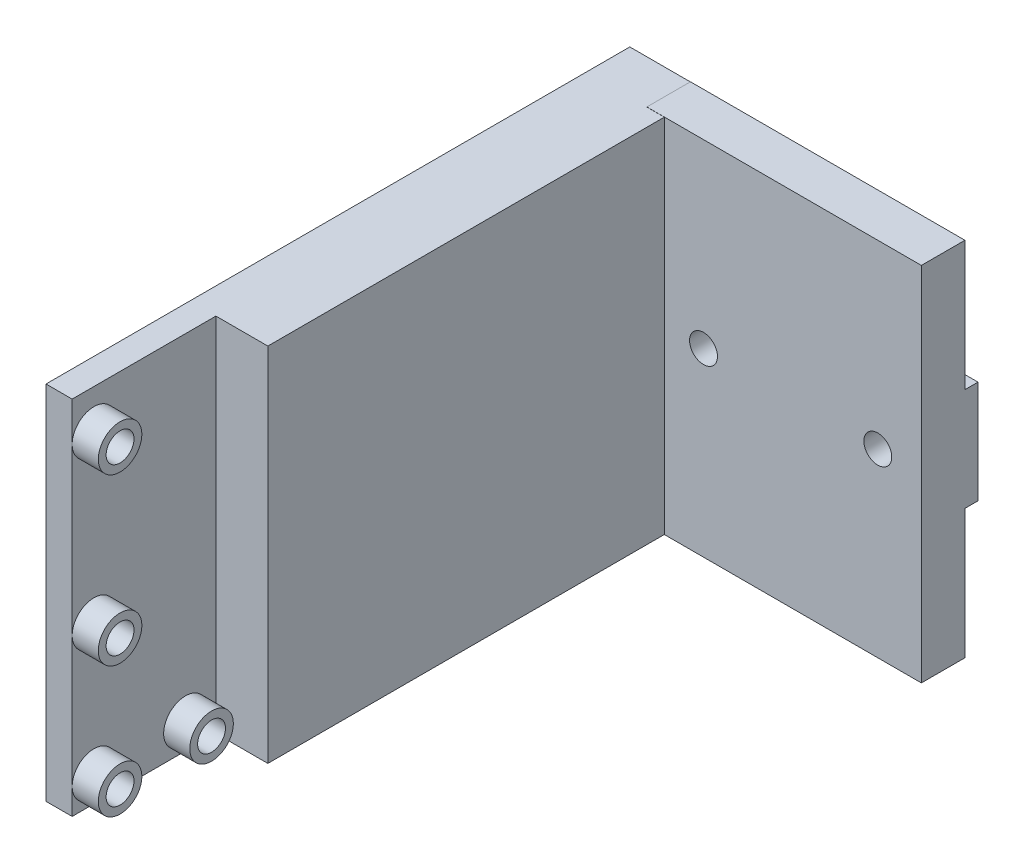
ISO-10303-21;
HEADER;
FILE_DESCRIPTION(('STEP AP214'),'2;1');
FILE_NAME('part.step','',(''),(''),'','','');
FILE_SCHEMA(('AUTOMOTIVE_DESIGN { 1 0 10303 214 1 1 1 1 }'));
ENDSEC;
DATA;
#1=APPLICATION_CONTEXT('core data for automotive mechanical design processes');
#2=APPLICATION_PROTOCOL_DEFINITION('international standard','automotive_design',2000,#1);
#3=PRODUCT_CONTEXT('',#1,'mechanical');
#4=PRODUCT('Part','Part','',(#3));
#5=PRODUCT_RELATED_PRODUCT_CATEGORY('part','',(#4));
#6=PRODUCT_DEFINITION_FORMATION('','',#4);
#7=PRODUCT_DEFINITION_CONTEXT('part definition',#1,'design');
#8=PRODUCT_DEFINITION('design','',#6,#7);
#9=PRODUCT_DEFINITION_SHAPE('','',#8);
#10=(LENGTH_UNIT() NAMED_UNIT(*) SI_UNIT(.MILLI.,.METRE.));
#11=(NAMED_UNIT(*) PLANE_ANGLE_UNIT() SI_UNIT($,.RADIAN.));
#12=(NAMED_UNIT(*) SI_UNIT($,.STERADIAN.) SOLID_ANGLE_UNIT());
#13=UNCERTAINTY_MEASURE_WITH_UNIT(LENGTH_MEASURE(1.E-05),#10,'distance_accuracy_value','');
#14=(GEOMETRIC_REPRESENTATION_CONTEXT(3) GLOBAL_UNCERTAINTY_ASSIGNED_CONTEXT((#13)) GLOBAL_UNIT_ASSIGNED_CONTEXT((#10,
#11,#12)) REPRESENTATION_CONTEXT('',''));
#15=CARTESIAN_POINT('',(0.,0.,0.));
#16=DIRECTION('',(0.,0.,1.));
#17=DIRECTION('',(1.,0.,0.));
#18=AXIS2_PLACEMENT_3D('',#15,#16,#17);
#19=CARTESIAN_POINT('',(0.,0.,0.));
#20=DIRECTION('',(0.,0.,1.));
#21=DIRECTION('',(1.,0.,0.));
#22=AXIS2_PLACEMENT_3D('',#19,#20,#21);
#23=PLANE('',#22);
#24=DIRECTION('',(1.,0.,0.));
#25=VECTOR('',#24,1.);
#26=CARTESIAN_POINT('',(-140.935025511959,-80.5841186301319,0.));
#27=LINE('',#26,#25);
#28=CARTESIAN_POINT('',(-130.,-80.5841186301319,0.));
#29=VERTEX_POINT('',#28);
#30=CARTESIAN_POINT('',(-91.5400685973667,-80.5841186301319,0.));
#31=VERTEX_POINT('',#30);
#32=EDGE_CURVE('E214',#29,#31,#27,.T.);
#33=ORIENTED_EDGE('',*,*,#32,.F.);
#34=DIRECTION('',(0.,1.,0.));
#35=VECTOR('',#34,1.);
#36=CARTESIAN_POINT('',(-130.,-65.7499999999999,0.));
#37=LINE('',#36,#35);
#38=CARTESIAN_POINT('',(-130.,-65.7499999999999,0.));
#39=VERTEX_POINT('',#38);
#40=EDGE_CURVE('E190',#29,#39,#37,.T.);
#41=ORIENTED_EDGE('',*,*,#40,.T.);
#42=DIRECTION('',(-1.,0.,0.));
#43=VECTOR('',#42,1.);
#44=CARTESIAN_POINT('',(-123.040068597367,-65.7499999999999,0.));
#45=LINE('',#44,#43);
#46=CARTESIAN_POINT('',(-123.040068597367,-65.7499999999999,0.));
#47=VERTEX_POINT('',#46);
#48=EDGE_CURVE('E172',#47,#39,#45,.T.);
#49=ORIENTED_EDGE('',*,*,#48,.F.);
#50=DIRECTION('',(0.,-1.,0.));
#51=VECTOR('',#50,1.);
#52=CARTESIAN_POINT('',(-123.040068597367,-65.7341186301319,0.));
#53=LINE('',#52,#51);
#54=CARTESIAN_POINT('',(-123.040068597367,-65.7341186301319,0.));
#55=VERTEX_POINT('',#54);
#56=EDGE_CURVE('E162',#55,#47,#53,.T.);
#57=ORIENTED_EDGE('',*,*,#56,.F.);
#58=DIRECTION('',(-1.,0.,0.));
#59=VECTOR('',#58,1.);
#60=CARTESIAN_POINT('',(-123.040068597367,-65.7341186301319,0.));
#61=LINE('',#60,#59);
#62=CARTESIAN_POINT('',(-91.5400685973667,-65.7341186301319,0.));
#63=VERTEX_POINT('',#62);
#64=EDGE_CURVE('E311',#63,#55,#61,.T.);
#65=ORIENTED_EDGE('',*,*,#64,.F.);
#66=DIRECTION('',(0.,1.,0.));
#67=VECTOR('',#66,1.);
#68=CARTESIAN_POINT('',(-91.5400685973667,-65.7341186301319,0.));
#69=LINE('',#68,#67);
#70=EDGE_CURVE('E161',#31,#63,#69,.T.);
#71=ORIENTED_EDGE('',*,*,#70,.F.);
#72=EDGE_LOOP('',(#33,#41,#49,#57,#65,#71));
#73=FACE_BOUND('',#72,.T.);
#74=ADVANCED_FACE('F44',(#73),#23,.F.);
#75=CARTESIAN_POINT('',(0.,0.,5.));
#76=DIRECTION('',(0.,0.,1.));
#77=DIRECTION('',(1.,0.,0.));
#78=AXIS2_PLACEMENT_3D('',#75,#76,#77);
#79=PLANE('',#78);
#80=CARTESIAN_POINT('',(-116.540068597367,-86.4908480241438,5.));
#81=DIRECTION('',(0.,0.,1.));
#82=DIRECTION('',(1.,0.,0.));
#83=AXIS2_PLACEMENT_3D('',#80,#81,#82);
#84=CIRCLE('',#83,1.60000000000001);
#85=CARTESIAN_POINT('',(-114.940068597367,-86.4908480241438,5.));
#86=VERTEX_POINT('',#85);
#87=EDGE_CURVE('E198',#86,#86,#84,.T.);
#88=ORIENTED_EDGE('',*,*,#87,.F.);
#89=EDGE_LOOP('',(#88));
#90=FACE_BOUND('',#89,.T.);
#91=CARTESIAN_POINT('',(-96.5400685973667,-86.4854645089343,5.));
#92=DIRECTION('',(0.,0.,1.));
#93=DIRECTION('',(1.,0.,0.));
#94=AXIS2_PLACEMENT_3D('',#91,#92,#93);
#95=CIRCLE('',#94,1.60000000000001);
#96=CARTESIAN_POINT('',(-94.9400685973667,-86.4854645089343,5.));
#97=VERTEX_POINT('',#96);
#98=EDGE_CURVE('E193',#97,#97,#95,.T.);
#99=ORIENTED_EDGE('',*,*,#98,.F.);
#100=EDGE_LOOP('',(#99));
#101=FACE_BOUND('',#100,.T.);
#102=DIRECTION('',(0.,-1.,0.));
#103=VECTOR('',#102,1.);
#104=CARTESIAN_POINT('',(-123.040068597367,-65.7341186301319,5.));
#105=LINE('',#104,#103);
#106=CARTESIAN_POINT('',(-123.040068597367,-65.7341186301319,5.));
#107=VERTEX_POINT('',#106);
#108=CARTESIAN_POINT('',(-123.040068597367,-65.7499999999999,5.));
#109=VERTEX_POINT('',#108);
#110=EDGE_CURVE('E307',#107,#109,#105,.T.);
#111=ORIENTED_EDGE('',*,*,#110,.T.);
#112=DIRECTION('',(1.,0.,0.));
#113=VECTOR('',#112,1.);
#114=CARTESIAN_POINT('',(0.,-65.7499999999999,5.));
#115=LINE('',#114,#113);
#116=CARTESIAN_POINT('',(-121.040068597367,-65.7499999999999,5.));
#117=VERTEX_POINT('',#116);
#118=EDGE_CURVE('E276',#109,#117,#115,.T.);
#119=ORIENTED_EDGE('',*,*,#118,.T.);
#120=DIRECTION('',(0.,1.,0.));
#121=VECTOR('',#120,1.);
#122=CARTESIAN_POINT('',(-121.040068597367,0.,5.));
#123=LINE('',#122,#121);
#124=CARTESIAN_POINT('',(-121.040068597367,-107.234118630132,5.));
#125=VERTEX_POINT('',#124);
#126=EDGE_CURVE('E279',#125,#117,#123,.T.);
#127=ORIENTED_EDGE('',*,*,#126,.F.);
#128=DIRECTION('',(1.,0.,0.));
#129=VECTOR('',#128,1.);
#130=CARTESIAN_POINT('',(-123.040068597367,-107.234118630132,5.));
#131=LINE('',#130,#129);
#132=CARTESIAN_POINT('',(-91.5400685973667,-107.234118630132,5.));
#133=VERTEX_POINT('',#132);
#134=EDGE_CURVE('E310',#125,#133,#131,.T.);
#135=ORIENTED_EDGE('',*,*,#134,.T.);
#136=DIRECTION('',(0.,1.,0.));
#137=VECTOR('',#136,1.);
#138=CARTESIAN_POINT('',(-91.5400685973667,-65.7341186301319,5.));
#139=LINE('',#138,#137);
#140=CARTESIAN_POINT('',(-91.5400685973667,-65.7341186301319,5.));
#141=VERTEX_POINT('',#140);
#142=EDGE_CURVE('E313',#133,#141,#139,.T.);
#143=ORIENTED_EDGE('',*,*,#142,.T.);
#144=DIRECTION('',(-1.,0.,0.));
#145=VECTOR('',#144,1.);
#146=CARTESIAN_POINT('',(-123.040068597367,-65.7341186301319,5.));
#147=LINE('',#146,#145);
#148=EDGE_CURVE('E315',#141,#107,#147,.T.);
#149=ORIENTED_EDGE('',*,*,#148,.T.);
#150=EDGE_LOOP('',(#111,#119,#127,#135,#143,#149));
#151=FACE_BOUND('',#150,.T.);
#152=ADVANCED_FACE('F337',(#90,#101,#151),#79,.T.);
#153=CARTESIAN_POINT('',(0.,0.,50.5));
#154=DIRECTION('',(0.,0.,-1.));
#155=DIRECTION('',(-1.,0.,0.));
#156=AXIS2_PLACEMENT_3D('',#153,#154,#155);
#157=PLANE('',#156);
#158=DIRECTION('',(0.,1.,0.));
#159=VECTOR('',#158,1.);
#160=CARTESIAN_POINT('',(-127.,-65.7499999999999,50.5));
#161=LINE('',#160,#159);
#162=CARTESIAN_POINT('',(-127.,-107.234118630132,50.5));
#163=VERTEX_POINT('',#162);
#164=CARTESIAN_POINT('',(-127.,-65.7499999999999,50.5));
#165=VERTEX_POINT('',#164);
#166=EDGE_CURVE('E281',#163,#165,#161,.T.);
#167=ORIENTED_EDGE('',*,*,#166,.F.);
#168=DIRECTION('',(1.,0.,0.));
#169=VECTOR('',#168,1.);
#170=CARTESIAN_POINT('',(-123.040068597367,-107.234118630132,50.5));
#171=LINE('',#170,#169);
#172=CARTESIAN_POINT('',(-121.040068597367,-107.234118630132,50.5));
#173=VERTEX_POINT('',#172);
#174=EDGE_CURVE('E304',#163,#173,#171,.T.);
#175=ORIENTED_EDGE('',*,*,#174,.T.);
#176=DIRECTION('',(0.,-1.,0.));
#177=VECTOR('',#176,1.);
#178=CARTESIAN_POINT('',(-121.040068597367,-107.234118630132,50.5));
#179=LINE('',#178,#177);
#180=CARTESIAN_POINT('',(-121.040068597367,-65.7499999999999,50.5));
#181=VERTEX_POINT('',#180);
#182=EDGE_CURVE('E271',#181,#173,#179,.T.);
#183=ORIENTED_EDGE('',*,*,#182,.F.);
#184=DIRECTION('',(-1.,0.,0.));
#185=VECTOR('',#184,1.);
#186=CARTESIAN_POINT('',(-123.040068597367,-65.7499999999999,50.5));
#187=LINE('',#186,#185);
#188=EDGE_CURVE('E302',#181,#165,#187,.T.);
#189=ORIENTED_EDGE('',*,*,#188,.T.);
#190=EDGE_LOOP('',(#167,#175,#183,#189));
#191=FACE_BOUND('',#190,.T.);
#192=ADVANCED_FACE('F348',(#191),#157,.F.);
#193=CARTESIAN_POINT('',(-123.040068597367,-65.7341186301319,5.));
#194=DIRECTION('',(1.,0.,0.));
#195=DIRECTION('',(0.,0.,-1.));
#196=AXIS2_PLACEMENT_3D('',#193,#194,#195);
#197=PLANE('',#196);
#198=DIRECTION('',(0.,0.,-1.));
#199=VECTOR('',#198,1.);
#200=CARTESIAN_POINT('',(-123.040068597367,-65.7499999999999,50.5));
#201=LINE('',#200,#199);
#202=EDGE_CURVE('E12',#109,#47,#201,.T.);
#203=ORIENTED_EDGE('',*,*,#202,.F.);
#204=ORIENTED_EDGE('',*,*,#110,.F.);
#205=DIRECTION('',(0.,0.,-1.));
#206=VECTOR('',#205,1.);
#207=CARTESIAN_POINT('',(-123.040068597367,-65.7341186301319,5.));
#208=LINE('',#207,#206);
#209=EDGE_CURVE('E317',#107,#55,#208,.T.);
#210=ORIENTED_EDGE('',*,*,#209,.T.);
#211=ORIENTED_EDGE('',*,*,#56,.T.);
#212=EDGE_LOOP('',(#203,#204,#210,#211));
#213=FACE_BOUND('',#212,.T.);
#214=ADVANCED_FACE('F46',(#213),#197,.F.);
#215=CARTESIAN_POINT('',(-123.040068597367,-107.234118630132,5.));
#216=DIRECTION('',(0.,1.,0.));
#217=DIRECTION('',(0.,0.,1.));
#218=AXIS2_PLACEMENT_3D('',#215,#216,#217);
#219=PLANE('',#218);
#220=DIRECTION('',(0.,0.,-1.));
#221=VECTOR('',#220,1.);
#222=CARTESIAN_POINT('',(-130.,-107.234118630132,67.));
#223=LINE('',#222,#221);
#224=CARTESIAN_POINT('',(-130.,-107.234118630132,67.));
#225=VERTEX_POINT('',#224);
#226=CARTESIAN_POINT('',(-130.,-107.234118630132,0.));
#227=VERTEX_POINT('',#226);
#228=EDGE_CURVE('E165',#225,#227,#223,.T.);
#229=ORIENTED_EDGE('',*,*,#228,.T.);
#230=DIRECTION('',(1.,0.,0.));
#231=VECTOR('',#230,1.);
#232=CARTESIAN_POINT('',(-123.040068597367,-107.234118630132,0.));
#233=LINE('',#232,#231);
#234=CARTESIAN_POINT('',(-91.5400685973667,-107.234118630132,0.));
#235=VERTEX_POINT('',#234);
#236=EDGE_CURVE('E152',#227,#235,#233,.T.);
#237=ORIENTED_EDGE('',*,*,#236,.T.);
#238=DIRECTION('',(0.,0.,-1.));
#239=VECTOR('',#238,1.);
#240=CARTESIAN_POINT('',(-91.5400685973667,-107.234118630132,5.));
#241=LINE('',#240,#239);
#242=EDGE_CURVE('E48',#133,#235,#241,.T.);
#243=ORIENTED_EDGE('',*,*,#242,.F.);
#244=ORIENTED_EDGE('',*,*,#134,.F.);
#245=DIRECTION('',(0.,0.,-1.));
#246=VECTOR('',#245,1.);
#247=CARTESIAN_POINT('',(-121.040068597367,-107.234118630132,0.));
#248=LINE('',#247,#246);
#249=EDGE_CURVE('E274',#173,#125,#248,.T.);
#250=ORIENTED_EDGE('',*,*,#249,.F.);
#251=ORIENTED_EDGE('',*,*,#174,.F.);
#252=DIRECTION('',(0.,0.,-1.));
#253=VECTOR('',#252,1.);
#254=CARTESIAN_POINT('',(-127.,-107.234118630132,67.));
#255=LINE('',#254,#253);
#256=CARTESIAN_POINT('',(-127.,-107.234118630132,67.));
#257=VERTEX_POINT('',#256);
#258=EDGE_CURVE('E173',#257,#163,#255,.T.);
#259=ORIENTED_EDGE('',*,*,#258,.F.);
#260=DIRECTION('',(1.,0.,0.));
#261=VECTOR('',#260,1.);
#262=CARTESIAN_POINT('',(-130.,-107.234118630132,67.));
#263=LINE('',#262,#261);
#264=EDGE_CURVE('E168',#225,#257,#263,.T.);
#265=ORIENTED_EDGE('',*,*,#264,.F.);
#266=EDGE_LOOP('',(#229,#237,#243,#244,#250,#251,#259,#265));
#267=FACE_BOUND('',#266,.T.);
#268=ADVANCED_FACE('F166',(#267),#219,.F.);
#269=CARTESIAN_POINT('',(-91.5400685973667,-65.7341186301319,5.));
#270=DIRECTION('',(-1.,0.,0.));
#271=DIRECTION('',(0.,0.,1.));
#272=AXIS2_PLACEMENT_3D('',#269,#270,#271);
#273=PLANE('',#272);
#274=CARTESIAN_POINT('',(-91.5400685973667,-92.3841186301319,0.));
#275=VERTEX_POINT('',#274);
#276=EDGE_CURVE('E157',#235,#275,#69,.T.);
#277=ORIENTED_EDGE('',*,*,#276,.T.);
#278=DIRECTION('',(0.,0.,-1.));
#279=VECTOR('',#278,1.);
#280=CARTESIAN_POINT('',(-91.5400685973667,-92.3841186301319,0.));
#281=LINE('',#280,#279);
#282=CARTESIAN_POINT('',(-91.5400685973667,-92.3841186301319,-1.5));
#283=VERTEX_POINT('',#282);
#284=EDGE_CURVE('E197',#275,#283,#281,.T.);
#285=ORIENTED_EDGE('',*,*,#284,.T.);
#286=DIRECTION('',(0.,1.,0.));
#287=VECTOR('',#286,1.);
#288=CARTESIAN_POINT('',(-91.5400685973667,-92.3841186301319,-1.5));
#289=LINE('',#288,#287);
#290=CARTESIAN_POINT('',(-91.5400685973667,-80.5841186301319,-1.5));
#291=VERTEX_POINT('',#290);
#292=EDGE_CURVE('E208',#283,#291,#289,.T.);
#293=ORIENTED_EDGE('',*,*,#292,.T.);
#294=DIRECTION('',(0.,0.,1.));
#295=VECTOR('',#294,1.);
#296=CARTESIAN_POINT('',(-91.5400685973667,-80.5841186301319,0.));
#297=LINE('',#296,#295);
#298=EDGE_CURVE('E211',#291,#31,#297,.T.);
#299=ORIENTED_EDGE('',*,*,#298,.T.);
#300=ORIENTED_EDGE('',*,*,#70,.T.);
#301=DIRECTION('',(0.,0.,-1.));
#302=VECTOR('',#301,1.);
#303=CARTESIAN_POINT('',(-91.5400685973667,-65.7341186301319,5.));
#304=LINE('',#303,#302);
#305=EDGE_CURVE('E322',#141,#63,#304,.T.);
#306=ORIENTED_EDGE('',*,*,#305,.F.);
#307=ORIENTED_EDGE('',*,*,#142,.F.);
#308=ORIENTED_EDGE('',*,*,#242,.T.);
#309=EDGE_LOOP('',(#277,#285,#293,#299,#300,#306,#307,#308));
#310=FACE_BOUND('',#309,.T.);
#311=ADVANCED_FACE('F330',(#310),#273,.F.);
#312=CARTESIAN_POINT('',(-123.040068597367,-65.7341186301319,5.));
#313=DIRECTION('',(0.,-1.,0.));
#314=DIRECTION('',(0.,0.,-1.));
#315=AXIS2_PLACEMENT_3D('',#312,#313,#314);
#316=PLANE('',#315);
#317=ORIENTED_EDGE('',*,*,#64,.T.);
#318=ORIENTED_EDGE('',*,*,#209,.F.);
#319=ORIENTED_EDGE('',*,*,#148,.F.);
#320=ORIENTED_EDGE('',*,*,#305,.T.);
#321=EDGE_LOOP('',(#317,#318,#319,#320));
#322=FACE_BOUND('',#321,.T.);
#323=ADVANCED_FACE('F394',(#322),#316,.F.);
#324=ORIENTED_EDGE('',*,*,#236,.F.);
#325=DIRECTION('',(0.,1.,0.));
#326=VECTOR('',#325,1.);
#327=CARTESIAN_POINT('',(-130.,-92.3841186301319,0.));
#328=LINE('',#327,#326);
#329=CARTESIAN_POINT('',(-130.,-92.3841186301319,0.));
#330=VERTEX_POINT('',#329);
#331=EDGE_CURVE('E156',#227,#330,#328,.T.);
#332=ORIENTED_EDGE('',*,*,#331,.T.);
#333=DIRECTION('',(1.,0.,0.));
#334=VECTOR('',#333,1.);
#335=CARTESIAN_POINT('',(-140.935025511959,-92.3841186301319,0.));
#336=LINE('',#335,#334);
#337=EDGE_CURVE('E60',#330,#275,#336,.T.);
#338=ORIENTED_EDGE('',*,*,#337,.T.);
#339=ORIENTED_EDGE('',*,*,#276,.F.);
#340=EDGE_LOOP('',(#324,#332,#338,#339));
#341=FACE_BOUND('',#340,.T.);
#342=ADVANCED_FACE('F154',(#341),#23,.F.);
#343=CARTESIAN_POINT('',(-123.040068597367,-65.7499999999999,50.5));
#344=DIRECTION('',(0.,-1.,0.));
#345=DIRECTION('',(0.,0.,-1.));
#346=AXIS2_PLACEMENT_3D('',#343,#344,#345);
#347=PLANE('',#346);
#348=ORIENTED_EDGE('',*,*,#48,.T.);
#349=DIRECTION('',(0.,0.,-1.));
#350=VECTOR('',#349,1.);
#351=CARTESIAN_POINT('',(-130.,-65.7499999999999,67.));
#352=LINE('',#351,#350);
#353=CARTESIAN_POINT('',(-130.,-65.7499999999999,67.));
#354=VERTEX_POINT('',#353);
#355=EDGE_CURVE('E293',#354,#39,#352,.T.);
#356=ORIENTED_EDGE('',*,*,#355,.F.);
#357=DIRECTION('',(-1.,0.,0.));
#358=VECTOR('',#357,1.);
#359=CARTESIAN_POINT('',(-130.,-65.7499999999999,67.));
#360=LINE('',#359,#358);
#361=CARTESIAN_POINT('',(-127.,-65.7499999999999,67.));
#362=VERTEX_POINT('',#361);
#363=EDGE_CURVE('E289',#362,#354,#360,.T.);
#364=ORIENTED_EDGE('',*,*,#363,.F.);
#365=DIRECTION('',(0.,0.,-1.));
#366=VECTOR('',#365,1.);
#367=CARTESIAN_POINT('',(-127.,-65.7499999999999,67.));
#368=LINE('',#367,#366);
#369=EDGE_CURVE('E297',#362,#165,#368,.T.);
#370=ORIENTED_EDGE('',*,*,#369,.T.);
#371=ORIENTED_EDGE('',*,*,#188,.F.);
#372=DIRECTION('',(0.,0.,1.));
#373=VECTOR('',#372,1.);
#374=CARTESIAN_POINT('',(-121.040068597367,-65.7499999999999,0.));
#375=LINE('',#374,#373);
#376=EDGE_CURVE('E266',#117,#181,#375,.T.);
#377=ORIENTED_EDGE('',*,*,#376,.F.);
#378=ORIENTED_EDGE('',*,*,#118,.F.);
#379=ORIENTED_EDGE('',*,*,#202,.T.);
#380=EDGE_LOOP('',(#348,#356,#364,#370,#371,#377,#378,#379));
#381=FACE_BOUND('',#380,.T.);
#382=ADVANCED_FACE('F343',(#381),#347,.F.);
#383=CARTESIAN_POINT('',(-130.,-65.7499999999999,67.));
#384=DIRECTION('',(1.,0.,0.));
#385=DIRECTION('',(0.,0.,-1.));
#386=AXIS2_PLACEMENT_3D('',#383,#384,#385);
#387=PLANE('',#386);
#388=CARTESIAN_POINT('',(-130.,-104.25,54.));
#389=DIRECTION('',(1.,0.,0.));
#390=DIRECTION('',(0.,0.,-1.));
#391=AXIS2_PLACEMENT_3D('',#388,#389,#390);
#392=CIRCLE('',#391,1.60000000000001);
#393=CARTESIAN_POINT('',(-130.,-104.25,52.4));
#394=VERTEX_POINT('',#393);
#395=EDGE_CURVE('E217',#394,#394,#392,.F.);
#396=ORIENTED_EDGE('',*,*,#395,.F.);
#397=EDGE_LOOP('',(#396));
#398=FACE_BOUND('',#397,.T.);
#399=CARTESIAN_POINT('',(-130.,-70.2499999999999,64.5));
#400=DIRECTION('',(1.,0.,0.));
#401=DIRECTION('',(0.,0.,-1.));
#402=AXIS2_PLACEMENT_3D('',#399,#400,#401);
#403=CIRCLE('',#402,1.60000000000002);
#404=CARTESIAN_POINT('',(-130.,-70.2499999999999,62.9));
#405=VERTEX_POINT('',#404);
#406=EDGE_CURVE('E227',#405,#405,#403,.F.);
#407=ORIENTED_EDGE('',*,*,#406,.F.);
#408=EDGE_LOOP('',(#407));
#409=FACE_BOUND('',#408,.T.);
#410=CARTESIAN_POINT('',(-130.,-89.2499999999999,64.5));
#411=DIRECTION('',(1.,0.,0.));
#412=DIRECTION('',(0.,0.,-1.));
#413=AXIS2_PLACEMENT_3D('',#410,#411,#412);
#414=CIRCLE('',#413,1.60000000000002);
#415=CARTESIAN_POINT('',(-130.,-89.2499999999999,62.9));
#416=VERTEX_POINT('',#415);
#417=EDGE_CURVE('E223',#416,#416,#414,.F.);
#418=ORIENTED_EDGE('',*,*,#417,.F.);
#419=EDGE_LOOP('',(#418));
#420=FACE_BOUND('',#419,.T.);
#421=CARTESIAN_POINT('',(-130.,-104.25,64.5));
#422=DIRECTION('',(1.,0.,0.));
#423=DIRECTION('',(0.,0.,-1.));
#424=AXIS2_PLACEMENT_3D('',#421,#422,#423);
#425=CIRCLE('',#424,1.60000000000002);
#426=CARTESIAN_POINT('',(-130.,-104.25,62.9));
#427=VERTEX_POINT('',#426);
#428=EDGE_CURVE('E226',#427,#427,#425,.F.);
#429=ORIENTED_EDGE('',*,*,#428,.F.);
#430=EDGE_LOOP('',(#429));
#431=FACE_BOUND('',#430,.T.);
#432=ORIENTED_EDGE('',*,*,#355,.T.);
#433=ORIENTED_EDGE('',*,*,#40,.F.);
#434=DIRECTION('',(0.,0.,1.));
#435=VECTOR('',#434,1.);
#436=CARTESIAN_POINT('',(-130.,-80.5841186301319,0.));
#437=LINE('',#436,#435);
#438=CARTESIAN_POINT('',(-130.,-80.5841186301319,-1.5));
#439=VERTEX_POINT('',#438);
#440=EDGE_CURVE('E187',#439,#29,#437,.T.);
#441=ORIENTED_EDGE('',*,*,#440,.F.);
#442=DIRECTION('',(0.,1.,0.));
#443=VECTOR('',#442,1.);
#444=CARTESIAN_POINT('',(-130.,-80.5841186301319,-1.5));
#445=LINE('',#444,#443);
#446=CARTESIAN_POINT('',(-130.,-92.3841186301319,-1.5));
#447=VERTEX_POINT('',#446);
#448=EDGE_CURVE('E182',#447,#439,#445,.T.);
#449=ORIENTED_EDGE('',*,*,#448,.F.);
#450=DIRECTION('',(0.,0.,-1.));
#451=VECTOR('',#450,1.);
#452=CARTESIAN_POINT('',(-130.,-92.3841186301319,-1.5));
#453=LINE('',#452,#451);
#454=EDGE_CURVE('E180',#330,#447,#453,.T.);
#455=ORIENTED_EDGE('',*,*,#454,.F.);
#456=ORIENTED_EDGE('',*,*,#331,.F.);
#457=ORIENTED_EDGE('',*,*,#228,.F.);
#458=DIRECTION('',(0.,-1.,0.));
#459=VECTOR('',#458,1.);
#460=CARTESIAN_POINT('',(-130.,-65.7499999999999,67.));
#461=LINE('',#460,#459);
#462=EDGE_CURVE('E282',#354,#225,#461,.T.);
#463=ORIENTED_EDGE('',*,*,#462,.F.);
#464=EDGE_LOOP('',(#432,#433,#441,#449,#455,#456,#457,#463));
#465=FACE_BOUND('',#464,.T.);
#466=ADVANCED_FACE('F177',(#398,#409,#420,#431,#465),#387,.F.);
#467=CARTESIAN_POINT('',(-127.,-65.7499999999999,67.));
#468=DIRECTION('',(-1.,0.,0.));
#469=DIRECTION('',(0.,0.,1.));
#470=AXIS2_PLACEMENT_3D('',#467,#468,#469);
#471=PLANE('',#470);
#472=CARTESIAN_POINT('',(-127.,-104.25,54.));
#473=DIRECTION('',(1.,0.,0.));
#474=DIRECTION('',(0.,0.,-1.));
#475=AXIS2_PLACEMENT_3D('',#472,#473,#474);
#476=CIRCLE('',#475,2.5);
#477=CARTESIAN_POINT('',(-127.,-104.25,51.5));
#478=VERTEX_POINT('',#477);
#479=EDGE_CURVE('E254',#478,#478,#476,.F.);
#480=ORIENTED_EDGE('',*,*,#479,.T.);
#481=EDGE_LOOP('',(#480));
#482=FACE_BOUND('',#481,.T.);
#483=DIRECTION('',(0.,1.,0.));
#484=VECTOR('',#483,1.);
#485=CARTESIAN_POINT('',(-127.,-65.7499999999999,67.));
#486=LINE('',#485,#484);
#487=CARTESIAN_POINT('',(-127.,-89.2499999999999,67.));
#488=VERTEX_POINT('',#487);
#489=CARTESIAN_POINT('',(-127.,-70.2499999999999,67.));
#490=VERTEX_POINT('',#489);
#491=EDGE_CURVE('E291',#488,#490,#486,.T.);
#492=ORIENTED_EDGE('',*,*,#491,.F.);
#493=CARTESIAN_POINT('',(-127.,-89.2499999999999,64.5));
#494=DIRECTION('',(-1.,0.,0.));
#495=DIRECTION('',(0.,0.,1.));
#496=AXIS2_PLACEMENT_3D('',#493,#494,#495);
#497=CIRCLE('',#496,2.5);
#498=EDGE_CURVE('E66',#488,#488,#497,.T.);
#499=ORIENTED_EDGE('',*,*,#498,.T.);
#500=CARTESIAN_POINT('',(-127.,-104.25,67.));
#501=VERTEX_POINT('',#500);
#502=EDGE_CURVE('E290',#501,#488,#486,.T.);
#503=ORIENTED_EDGE('',*,*,#502,.F.);
#504=CARTESIAN_POINT('',(-127.,-104.25,64.5));
#505=DIRECTION('',(1.,0.,0.));
#506=DIRECTION('',(0.,0.,-1.));
#507=AXIS2_PLACEMENT_3D('',#504,#505,#506);
#508=CIRCLE('',#507,2.5);
#509=EDGE_CURVE('E242',#501,#501,#508,.F.);
#510=ORIENTED_EDGE('',*,*,#509,.T.);
#511=EDGE_CURVE('E286',#257,#501,#486,.T.);
#512=ORIENTED_EDGE('',*,*,#511,.F.);
#513=ORIENTED_EDGE('',*,*,#258,.T.);
#514=ORIENTED_EDGE('',*,*,#166,.T.);
#515=ORIENTED_EDGE('',*,*,#369,.F.);
#516=EDGE_CURVE('E285',#490,#362,#486,.T.);
#517=ORIENTED_EDGE('',*,*,#516,.F.);
#518=CARTESIAN_POINT('',(-127.,-70.2499999999999,64.5));
#519=DIRECTION('',(1.,0.,0.));
#520=DIRECTION('',(0.,0.,-1.));
#521=AXIS2_PLACEMENT_3D('',#518,#519,#520);
#522=CIRCLE('',#521,2.5);
#523=EDGE_CURVE('E251',#490,#490,#522,.F.);
#524=ORIENTED_EDGE('',*,*,#523,.T.);
#525=EDGE_LOOP('',(#492,#499,#503,#510,#512,#513,#514,#515,#517,#524));
#526=FACE_BOUND('',#525,.T.);
#527=ADVANCED_FACE('F351',(#482,#526),#471,.F.);
#528=CARTESIAN_POINT('',(0.,0.,67.));
#529=DIRECTION('',(0.,0.,1.));
#530=DIRECTION('',(1.,0.,0.));
#531=AXIS2_PLACEMENT_3D('',#528,#529,#530);
#532=PLANE('',#531);
#533=ORIENTED_EDGE('',*,*,#462,.T.);
#534=ORIENTED_EDGE('',*,*,#264,.T.);
#535=ORIENTED_EDGE('',*,*,#511,.T.);
#536=ORIENTED_EDGE('',*,*,#502,.T.);
#537=ORIENTED_EDGE('',*,*,#491,.T.);
#538=ORIENTED_EDGE('',*,*,#516,.T.);
#539=ORIENTED_EDGE('',*,*,#363,.T.);
#540=EDGE_LOOP('',(#533,#534,#535,#536,#537,#538,#539));
#541=FACE_BOUND('',#540,.T.);
#542=ADVANCED_FACE('F357',(#541),#532,.T.);
#543=CARTESIAN_POINT('',(-121.040068597367,0.,0.));
#544=DIRECTION('',(1.,0.,0.));
#545=DIRECTION('',(0.,0.,-1.));
#546=AXIS2_PLACEMENT_3D('',#543,#544,#545);
#547=PLANE('',#546);
#548=ORIENTED_EDGE('',*,*,#249,.T.);
#549=ORIENTED_EDGE('',*,*,#126,.T.);
#550=ORIENTED_EDGE('',*,*,#376,.T.);
#551=ORIENTED_EDGE('',*,*,#182,.T.);
#552=EDGE_LOOP('',(#548,#549,#550,#551));
#553=FACE_BOUND('',#552,.T.);
#554=ADVANCED_FACE('F340',(#553),#547,.T.);
#555=CARTESIAN_POINT('',(-124.,-104.25,54.));
#556=DIRECTION('',(-1.,0.,0.));
#557=DIRECTION('',(0.,0.,1.));
#558=AXIS2_PLACEMENT_3D('',#555,#556,#557);
#559=CYLINDRICAL_SURFACE('',#558,2.5);
#560=CARTESIAN_POINT('',(-124.,-104.25,54.));
#561=DIRECTION('',(1.,0.,0.));
#562=DIRECTION('',(0.,0.,-1.));
#563=AXIS2_PLACEMENT_3D('',#560,#561,#562);
#564=CIRCLE('',#563,2.5);
#565=CARTESIAN_POINT('',(-124.,-104.25,51.5));
#566=VERTEX_POINT('',#565);
#567=EDGE_CURVE('E260',#566,#566,#564,.F.);
#568=ORIENTED_EDGE('',*,*,#567,.T.);
#569=EDGE_LOOP('',(#568));
#570=FACE_BOUND('',#569,.T.);
#571=ORIENTED_EDGE('',*,*,#479,.F.);
#572=EDGE_LOOP('',(#571));
#573=FACE_BOUND('',#572,.T.);
#574=ADVANCED_FACE('F428',(#570,#573),#559,.T.);
#575=CARTESIAN_POINT('',(-124.,-104.25,54.));
#576=DIRECTION('',(-1.,0.,0.));
#577=DIRECTION('',(0.,0.,1.));
#578=AXIS2_PLACEMENT_3D('',#575,#576,#577);
#579=CYLINDRICAL_SURFACE('',#578,1.60000000000001);
#580=CARTESIAN_POINT('',(-124.,-104.25,54.));
#581=DIRECTION('',(1.,0.,0.));
#582=DIRECTION('',(0.,0.,-1.));
#583=AXIS2_PLACEMENT_3D('',#580,#581,#582);
#584=CIRCLE('',#583,1.60000000000001);
#585=CARTESIAN_POINT('',(-124.,-104.25,52.4));
#586=VERTEX_POINT('',#585);
#587=EDGE_CURVE('E263',#586,#586,#584,.F.);
#588=ORIENTED_EDGE('',*,*,#587,.F.);
#589=EDGE_LOOP('',(#588));
#590=FACE_BOUND('',#589,.T.);
#591=ORIENTED_EDGE('',*,*,#395,.T.);
#592=EDGE_LOOP('',(#591));
#593=FACE_BOUND('',#592,.T.);
#594=ADVANCED_FACE('F431',(#590,#593),#579,.F.);
#595=CARTESIAN_POINT('',(-124.,0.,0.));
#596=DIRECTION('',(1.,0.,0.));
#597=DIRECTION('',(0.,0.,-1.));
#598=AXIS2_PLACEMENT_3D('',#595,#596,#597);
#599=PLANE('',#598);
#600=ORIENTED_EDGE('',*,*,#567,.F.);
#601=EDGE_LOOP('',(#600));
#602=FACE_BOUND('',#601,.T.);
#603=ORIENTED_EDGE('',*,*,#587,.T.);
#604=EDGE_LOOP('',(#603));
#605=FACE_BOUND('',#604,.T.);
#606=ADVANCED_FACE('F435',(#602,#605),#599,.T.);
#607=CARTESIAN_POINT('',(-124.,-70.2499999999999,64.5));
#608=DIRECTION('',(-1.,0.,0.));
#609=DIRECTION('',(0.,0.,1.));
#610=AXIS2_PLACEMENT_3D('',#607,#608,#609);
#611=CYLINDRICAL_SURFACE('',#610,1.60000000000002);
#612=CARTESIAN_POINT('',(-124.,-70.2499999999999,64.5));
#613=DIRECTION('',(1.,0.,0.));
#614=DIRECTION('',(0.,0.,-1.));
#615=AXIS2_PLACEMENT_3D('',#612,#613,#614);
#616=CIRCLE('',#615,1.60000000000002);
#617=CARTESIAN_POINT('',(-124.,-70.2499999999999,62.9));
#618=VERTEX_POINT('',#617);
#619=EDGE_CURVE('E255',#618,#618,#616,.F.);
#620=ORIENTED_EDGE('',*,*,#619,.F.);
#621=EDGE_LOOP('',(#620));
#622=FACE_BOUND('',#621,.T.);
#623=ORIENTED_EDGE('',*,*,#406,.T.);
#624=EDGE_LOOP('',(#623));
#625=FACE_BOUND('',#624,.T.);
#626=ADVANCED_FACE('F439',(#622,#625),#611,.F.);
#627=CARTESIAN_POINT('',(-124.,-70.2499999999999,64.5));
#628=DIRECTION('',(-1.,0.,0.));
#629=DIRECTION('',(0.,0.,1.));
#630=AXIS2_PLACEMENT_3D('',#627,#628,#629);
#631=CYLINDRICAL_SURFACE('',#630,2.5);
#632=CARTESIAN_POINT('',(-124.,-70.2499999999999,64.5));
#633=DIRECTION('',(1.,0.,0.));
#634=DIRECTION('',(0.,0.,-1.));
#635=AXIS2_PLACEMENT_3D('',#632,#633,#634);
#636=CIRCLE('',#635,2.5);
#637=CARTESIAN_POINT('',(-124.,-70.2499999999999,62.));
#638=VERTEX_POINT('',#637);
#639=EDGE_CURVE('E245',#638,#638,#636,.F.);
#640=ORIENTED_EDGE('',*,*,#639,.T.);
#641=EDGE_LOOP('',(#640));
#642=FACE_BOUND('',#641,.T.);
#643=ORIENTED_EDGE('',*,*,#523,.F.);
#644=EDGE_LOOP('',(#643));
#645=FACE_BOUND('',#644,.T.);
#646=ADVANCED_FACE('F445',(#642,#645),#631,.T.);
#647=CARTESIAN_POINT('',(-124.,0.,0.));
#648=DIRECTION('',(1.,0.,0.));
#649=DIRECTION('',(0.,0.,-1.));
#650=AXIS2_PLACEMENT_3D('',#647,#648,#649);
#651=PLANE('',#650);
#652=ORIENTED_EDGE('',*,*,#619,.T.);
#653=EDGE_LOOP('',(#652));
#654=FACE_BOUND('',#653,.T.);
#655=ORIENTED_EDGE('',*,*,#639,.F.);
#656=EDGE_LOOP('',(#655));
#657=FACE_BOUND('',#656,.T.);
#658=ADVANCED_FACE('F441',(#654,#657),#651,.T.);
#659=CARTESIAN_POINT('',(-124.,-104.25,64.5));
#660=DIRECTION('',(-1.,0.,0.));
#661=DIRECTION('',(0.,0.,1.));
#662=AXIS2_PLACEMENT_3D('',#659,#660,#661);
#663=CYLINDRICAL_SURFACE('',#662,2.5);
#664=CARTESIAN_POINT('',(-124.,-104.25,64.5));
#665=DIRECTION('',(1.,0.,0.));
#666=DIRECTION('',(0.,0.,-1.));
#667=AXIS2_PLACEMENT_3D('',#664,#665,#666);
#668=CIRCLE('',#667,2.5);
#669=CARTESIAN_POINT('',(-124.,-104.25,62.));
#670=VERTEX_POINT('',#669);
#671=EDGE_CURVE('E246',#670,#670,#668,.F.);
#672=ORIENTED_EDGE('',*,*,#671,.T.);
#673=EDGE_LOOP('',(#672));
#674=FACE_BOUND('',#673,.T.);
#675=ORIENTED_EDGE('',*,*,#509,.F.);
#676=EDGE_LOOP('',(#675));
#677=FACE_BOUND('',#676,.T.);
#678=ADVANCED_FACE('F444',(#674,#677),#663,.T.);
#679=CARTESIAN_POINT('',(-124.,-104.25,64.5));
#680=DIRECTION('',(-1.,0.,0.));
#681=DIRECTION('',(0.,0.,1.));
#682=AXIS2_PLACEMENT_3D('',#679,#680,#681);
#683=CYLINDRICAL_SURFACE('',#682,1.60000000000002);
#684=CARTESIAN_POINT('',(-124.,-104.25,64.5));
#685=DIRECTION('',(1.,0.,0.));
#686=DIRECTION('',(0.,0.,-1.));
#687=AXIS2_PLACEMENT_3D('',#684,#685,#686);
#688=CIRCLE('',#687,1.60000000000002);
#689=CARTESIAN_POINT('',(-124.,-104.25,62.9));
#690=VERTEX_POINT('',#689);
#691=EDGE_CURVE('E241',#690,#690,#688,.F.);
#692=ORIENTED_EDGE('',*,*,#691,.F.);
#693=EDGE_LOOP('',(#692));
#694=FACE_BOUND('',#693,.T.);
#695=ORIENTED_EDGE('',*,*,#428,.T.);
#696=EDGE_LOOP('',(#695));
#697=FACE_BOUND('',#696,.T.);
#698=ADVANCED_FACE('F457',(#694,#697),#683,.F.);
#699=CARTESIAN_POINT('',(-124.,0.,0.));
#700=DIRECTION('',(1.,0.,0.));
#701=DIRECTION('',(0.,0.,-1.));
#702=AXIS2_PLACEMENT_3D('',#699,#700,#701);
#703=PLANE('',#702);
#704=ORIENTED_EDGE('',*,*,#671,.F.);
#705=EDGE_LOOP('',(#704));
#706=FACE_BOUND('',#705,.T.);
#707=ORIENTED_EDGE('',*,*,#691,.T.);
#708=EDGE_LOOP('',(#707));
#709=FACE_BOUND('',#708,.T.);
#710=ADVANCED_FACE('F453',(#706,#709),#703,.T.);
#711=CARTESIAN_POINT('',(-124.,-89.2499999999999,64.5));
#712=DIRECTION('',(-1.,0.,0.));
#713=DIRECTION('',(0.,0.,1.));
#714=AXIS2_PLACEMENT_3D('',#711,#712,#713);
#715=CYLINDRICAL_SURFACE('',#714,2.5);
#716=CARTESIAN_POINT('',(-124.,-89.2499999999999,64.5));
#717=DIRECTION('',(-1.,0.,0.));
#718=DIRECTION('',(0.,0.,1.));
#719=AXIS2_PLACEMENT_3D('',#716,#717,#718);
#720=CIRCLE('',#719,2.5);
#721=CARTESIAN_POINT('',(-124.,-89.2499999999999,67.));
#722=VERTEX_POINT('',#721);
#723=EDGE_CURVE('E234',#722,#722,#720,.T.);
#724=ORIENTED_EDGE('',*,*,#723,.T.);
#725=EDGE_LOOP('',(#724));
#726=FACE_BOUND('',#725,.T.);
#727=ORIENTED_EDGE('',*,*,#498,.F.);
#728=EDGE_LOOP('',(#727));
#729=FACE_BOUND('',#728,.T.);
#730=ADVANCED_FACE('F456',(#726,#729),#715,.T.);
#731=CARTESIAN_POINT('',(-124.,-89.2499999999999,64.5));
#732=DIRECTION('',(-1.,0.,0.));
#733=DIRECTION('',(0.,0.,1.));
#734=AXIS2_PLACEMENT_3D('',#731,#732,#733);
#735=PLANE('',#734);
#736=CARTESIAN_POINT('',(-124.,-89.2499999999999,64.5));
#737=DIRECTION('',(-1.,0.,0.));
#738=DIRECTION('',(0.,0.,1.));
#739=AXIS2_PLACEMENT_3D('',#736,#737,#738);
#740=CIRCLE('',#739,1.60000000000002);
#741=CARTESIAN_POINT('',(-124.,-89.2499999999999,66.1));
#742=VERTEX_POINT('',#741);
#743=EDGE_CURVE('E236',#742,#742,#740,.T.);
#744=ORIENTED_EDGE('',*,*,#743,.T.);
#745=EDGE_LOOP('',(#744));
#746=FACE_BOUND('',#745,.T.);
#747=ORIENTED_EDGE('',*,*,#723,.F.);
#748=EDGE_LOOP('',(#747));
#749=FACE_BOUND('',#748,.T.);
#750=ADVANCED_FACE('F468',(#746,#749),#735,.F.);
#751=CARTESIAN_POINT('',(-124.,-89.2499999999999,64.5));
#752=DIRECTION('',(-1.,0.,0.));
#753=DIRECTION('',(0.,0.,1.));
#754=AXIS2_PLACEMENT_3D('',#751,#752,#753);
#755=CYLINDRICAL_SURFACE('',#754,1.60000000000002);
#756=ORIENTED_EDGE('',*,*,#743,.F.);
#757=EDGE_LOOP('',(#756));
#758=FACE_BOUND('',#757,.T.);
#759=ORIENTED_EDGE('',*,*,#417,.T.);
#760=EDGE_LOOP('',(#759));
#761=FACE_BOUND('',#760,.T.);
#762=ADVANCED_FACE('F465',(#758,#761),#755,.F.);
#763=CARTESIAN_POINT('',(-140.935025511959,-80.5841186301319,0.));
#764=DIRECTION('',(0.,1.,0.));
#765=DIRECTION('',(0.,0.,1.));
#766=AXIS2_PLACEMENT_3D('',#763,#764,#765);
#767=PLANE('',#766);
#768=DIRECTION('',(1.,0.,0.));
#769=VECTOR('',#768,1.);
#770=CARTESIAN_POINT('',(-140.935025511959,-80.5841186301319,-1.5));
#771=LINE('',#770,#769);
#772=EDGE_CURVE('E218',#439,#291,#771,.T.);
#773=ORIENTED_EDGE('',*,*,#772,.F.);
#774=ORIENTED_EDGE('',*,*,#440,.T.);
#775=ORIENTED_EDGE('',*,*,#32,.T.);
#776=ORIENTED_EDGE('',*,*,#298,.F.);
#777=EDGE_LOOP('',(#773,#774,#775,#776));
#778=FACE_BOUND('',#777,.T.);
#779=ADVANCED_FACE('F366',(#778),#767,.T.);
#780=CARTESIAN_POINT('',(-140.935025511959,-92.3841186301319,-1.5));
#781=DIRECTION('',(0.,0.,-1.));
#782=DIRECTION('',(-1.,0.,0.));
#783=AXIS2_PLACEMENT_3D('',#780,#781,#782);
#784=PLANE('',#783);
#785=CARTESIAN_POINT('',(-116.540068597367,-86.4908480241438,-1.5));
#786=DIRECTION('',(0.,0.,1.));
#787=DIRECTION('',(1.,0.,0.));
#788=AXIS2_PLACEMENT_3D('',#785,#786,#787);
#789=CIRCLE('',#788,1.60000000000001);
#790=CARTESIAN_POINT('',(-114.940068597367,-86.4908480241438,-1.5));
#791=VERTEX_POINT('',#790);
#792=EDGE_CURVE('E194',#791,#791,#789,.T.);
#793=ORIENTED_EDGE('',*,*,#792,.T.);
#794=EDGE_LOOP('',(#793));
#795=FACE_BOUND('',#794,.T.);
#796=CARTESIAN_POINT('',(-96.5400685973667,-86.4854645089343,-1.5));
#797=DIRECTION('',(0.,0.,1.));
#798=DIRECTION('',(1.,0.,0.));
#799=AXIS2_PLACEMENT_3D('',#796,#797,#798);
#800=CIRCLE('',#799,1.60000000000001);
#801=CARTESIAN_POINT('',(-94.9400685973667,-86.4854645089343,-1.5));
#802=VERTEX_POINT('',#801);
#803=EDGE_CURVE('E201',#802,#802,#800,.T.);
#804=ORIENTED_EDGE('',*,*,#803,.T.);
#805=EDGE_LOOP('',(#804));
#806=FACE_BOUND('',#805,.T.);
#807=DIRECTION('',(1.,0.,0.));
#808=VECTOR('',#807,1.);
#809=CARTESIAN_POINT('',(-140.935025511959,-92.3841186301319,-1.5));
#810=LINE('',#809,#808);
#811=EDGE_CURVE('E220',#447,#283,#810,.T.);
#812=ORIENTED_EDGE('',*,*,#811,.F.);
#813=ORIENTED_EDGE('',*,*,#448,.T.);
#814=ORIENTED_EDGE('',*,*,#772,.T.);
#815=ORIENTED_EDGE('',*,*,#292,.F.);
#816=EDGE_LOOP('',(#812,#813,#814,#815));
#817=FACE_BOUND('',#816,.T.);
#818=ADVANCED_FACE('F369',(#795,#806,#817),#784,.T.);
#819=CARTESIAN_POINT('',(-140.935025511959,-92.3841186301319,0.));
#820=DIRECTION('',(0.,-1.,0.));
#821=DIRECTION('',(0.,0.,-1.));
#822=AXIS2_PLACEMENT_3D('',#819,#820,#821);
#823=PLANE('',#822);
#824=ORIENTED_EDGE('',*,*,#337,.F.);
#825=ORIENTED_EDGE('',*,*,#454,.T.);
#826=ORIENTED_EDGE('',*,*,#811,.T.);
#827=ORIENTED_EDGE('',*,*,#284,.F.);
#828=EDGE_LOOP('',(#824,#825,#826,#827));
#829=FACE_BOUND('',#828,.T.);
#830=ADVANCED_FACE('F371',(#829),#823,.T.);
#831=CARTESIAN_POINT('',(-96.5400685973667,-86.4854645089343,-1.5));
#832=DIRECTION('',(0.,0.,1.));
#833=DIRECTION('',(1.,0.,0.));
#834=AXIS2_PLACEMENT_3D('',#831,#832,#833);
#835=CYLINDRICAL_SURFACE('',#834,1.60000000000001);
#836=ORIENTED_EDGE('',*,*,#803,.F.);
#837=EDGE_LOOP('',(#836));
#838=FACE_BOUND('',#837,.T.);
#839=ORIENTED_EDGE('',*,*,#98,.T.);
#840=EDGE_LOOP('',(#839));
#841=FACE_BOUND('',#840,.T.);
#842=ADVANCED_FACE('F373',(#838,#841),#835,.F.);
#843=CARTESIAN_POINT('',(-116.540068597367,-86.4908480241438,-1.5));
#844=DIRECTION('',(0.,0.,1.));
#845=DIRECTION('',(1.,0.,0.));
#846=AXIS2_PLACEMENT_3D('',#843,#844,#845);
#847=CYLINDRICAL_SURFACE('',#846,1.60000000000001);
#848=ORIENTED_EDGE('',*,*,#792,.F.);
#849=EDGE_LOOP('',(#848));
#850=FACE_BOUND('',#849,.T.);
#851=ORIENTED_EDGE('',*,*,#87,.T.);
#852=EDGE_LOOP('',(#851));
#853=FACE_BOUND('',#852,.T.);
#854=ADVANCED_FACE('F379',(#850,#853),#847,.F.);
#855=CLOSED_SHELL('',(#74,#152,#192,#214,#268,#311,#323,#342,#382,#466,#527,#542,#554,#574,#594,
#606,#626,#646,#658,#678,#698,#710,#730,#750,#762,#779,#818,#830,#842,#854));
#856=MANIFOLD_SOLID_BREP('B2',#855);
#857=ADVANCED_BREP_SHAPE_REPRESENTATION('',(#18,#856),#14);
#858=SHAPE_DEFINITION_REPRESENTATION(#9,#857);
ENDSEC;
END-ISO-10303-21;
